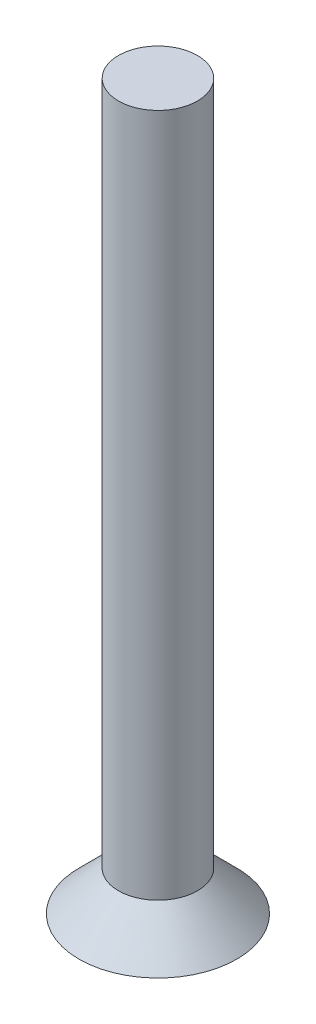
ISO-10303-21;
HEADER;
FILE_DESCRIPTION(('STEP AP214'),'2;1');
FILE_NAME('part.step','',(''),(''),'','','');
FILE_SCHEMA(('AUTOMOTIVE_DESIGN { 1 0 10303 214 1 1 1 1 }'));
ENDSEC;
DATA;
#1=APPLICATION_CONTEXT('core data for automotive mechanical design processes');
#2=APPLICATION_PROTOCOL_DEFINITION('international standard','automotive_design',2000,#1);
#3=PRODUCT_CONTEXT('',#1,'mechanical');
#4=PRODUCT('Part','Part','',(#3));
#5=PRODUCT_RELATED_PRODUCT_CATEGORY('part','',(#4));
#6=PRODUCT_DEFINITION_FORMATION('','',#4);
#7=PRODUCT_DEFINITION_CONTEXT('part definition',#1,'design');
#8=PRODUCT_DEFINITION('design','',#6,#7);
#9=PRODUCT_DEFINITION_SHAPE('','',#8);
#10=(LENGTH_UNIT() NAMED_UNIT(*) SI_UNIT(.MILLI.,.METRE.));
#11=(NAMED_UNIT(*) PLANE_ANGLE_UNIT() SI_UNIT($,.RADIAN.));
#12=(NAMED_UNIT(*) SI_UNIT($,.STERADIAN.) SOLID_ANGLE_UNIT());
#13=UNCERTAINTY_MEASURE_WITH_UNIT(LENGTH_MEASURE(1.E-05),#10,'distance_accuracy_value','');
#14=(GEOMETRIC_REPRESENTATION_CONTEXT(3) GLOBAL_UNCERTAINTY_ASSIGNED_CONTEXT((#13)) GLOBAL_UNIT_ASSIGNED_CONTEXT((#10,
#11,#12)) REPRESENTATION_CONTEXT('',''));
#15=CARTESIAN_POINT('',(0.,0.,0.));
#16=DIRECTION('',(0.,0.,1.));
#17=DIRECTION('',(1.,0.,0.));
#18=AXIS2_PLACEMENT_3D('',#15,#16,#17);
#19=CARTESIAN_POINT('',(0.,-15.,0.));
#20=DIRECTION('',(0.,-1.,0.));
#21=DIRECTION('',(0.,0.,-1.));
#22=AXIS2_PLACEMENT_3D('',#19,#20,#21);
#23=CONICAL_SURFACE('',#22,6.,0.785398163397454);
#24=CARTESIAN_POINT('',(0.,-12.,0.));
#25=DIRECTION('',(0.,1.,0.));
#26=DIRECTION('',(0.,0.,1.));
#27=AXIS2_PLACEMENT_3D('',#24,#25,#26);
#28=CIRCLE('',#27,3.);
#29=CARTESIAN_POINT('',(0.,-12.,3.));
#30=VERTEX_POINT('',#29);
#31=EDGE_CURVE('E10',#30,#30,#28,.T.);
#32=ORIENTED_EDGE('',*,*,#31,.F.);
#33=EDGE_LOOP('',(#32));
#34=FACE_BOUND('',#33,.T.);
#35=CARTESIAN_POINT('',(0.,-15.,0.));
#36=DIRECTION('',(0.,1.,0.));
#37=DIRECTION('',(0.,0.,1.));
#38=AXIS2_PLACEMENT_3D('',#35,#36,#37);
#39=CIRCLE('',#38,6.);
#40=CARTESIAN_POINT('',(0.,-15.,6.));
#41=VERTEX_POINT('',#40);
#42=EDGE_CURVE('E38',#41,#41,#39,.T.);
#43=ORIENTED_EDGE('',*,*,#42,.T.);
#44=EDGE_LOOP('',(#43));
#45=FACE_BOUND('',#44,.T.);
#46=ADVANCED_FACE('F28',(#34,#45),#23,.T.);
#47=CARTESIAN_POINT('',(0.,0.,0.));
#48=DIRECTION('',(0.,1.,0.));
#49=DIRECTION('',(0.,0.,1.));
#50=AXIS2_PLACEMENT_3D('',#47,#48,#49);
#51=CYLINDRICAL_SURFACE('',#50,3.);
#52=CARTESIAN_POINT('',(0.,40.,0.));
#53=DIRECTION('',(0.,1.,0.));
#54=DIRECTION('',(0.,0.,1.));
#55=AXIS2_PLACEMENT_3D('',#52,#53,#54);
#56=CIRCLE('',#55,3.);
#57=CARTESIAN_POINT('',(0.,40.,3.));
#58=VERTEX_POINT('',#57);
#59=EDGE_CURVE('E34',#58,#58,#56,.T.);
#60=ORIENTED_EDGE('',*,*,#59,.F.);
#61=EDGE_LOOP('',(#60));
#62=FACE_BOUND('',#61,.T.);
#63=ORIENTED_EDGE('',*,*,#31,.T.);
#64=EDGE_LOOP('',(#63));
#65=FACE_BOUND('',#64,.T.);
#66=ADVANCED_FACE('F53',(#62,#65),#51,.T.);
#67=CARTESIAN_POINT('',(0.,40.,0.));
#68=DIRECTION('',(0.,-1.,0.));
#69=DIRECTION('',(0.,0.,-1.));
#70=AXIS2_PLACEMENT_3D('',#67,#68,#69);
#71=PLANE('',#70);
#72=ORIENTED_EDGE('',*,*,#59,.T.);
#73=EDGE_LOOP('',(#72));
#74=FACE_BOUND('',#73,.T.);
#75=ADVANCED_FACE('F48',(#74),#71,.F.);
#76=CARTESIAN_POINT('',(6.,-15.,0.));
#77=DIRECTION('',(0.,1.,0.));
#78=DIRECTION('',(0.,0.,1.));
#79=AXIS2_PLACEMENT_3D('',#76,#77,#78);
#80=PLANE('',#79);
#81=ORIENTED_EDGE('',*,*,#42,.F.);
#82=EDGE_LOOP('',(#81));
#83=FACE_BOUND('',#82,.T.);
#84=ADVANCED_FACE('F46',(#83),#80,.F.);
#85=CLOSED_SHELL('',(#46,#66,#75,#84));
#86=MANIFOLD_SOLID_BREP('B2',#85);
#87=ADVANCED_BREP_SHAPE_REPRESENTATION('',(#18,#86),#14);
#88=SHAPE_DEFINITION_REPRESENTATION(#9,#87);
ENDSEC;
END-ISO-10303-21;
